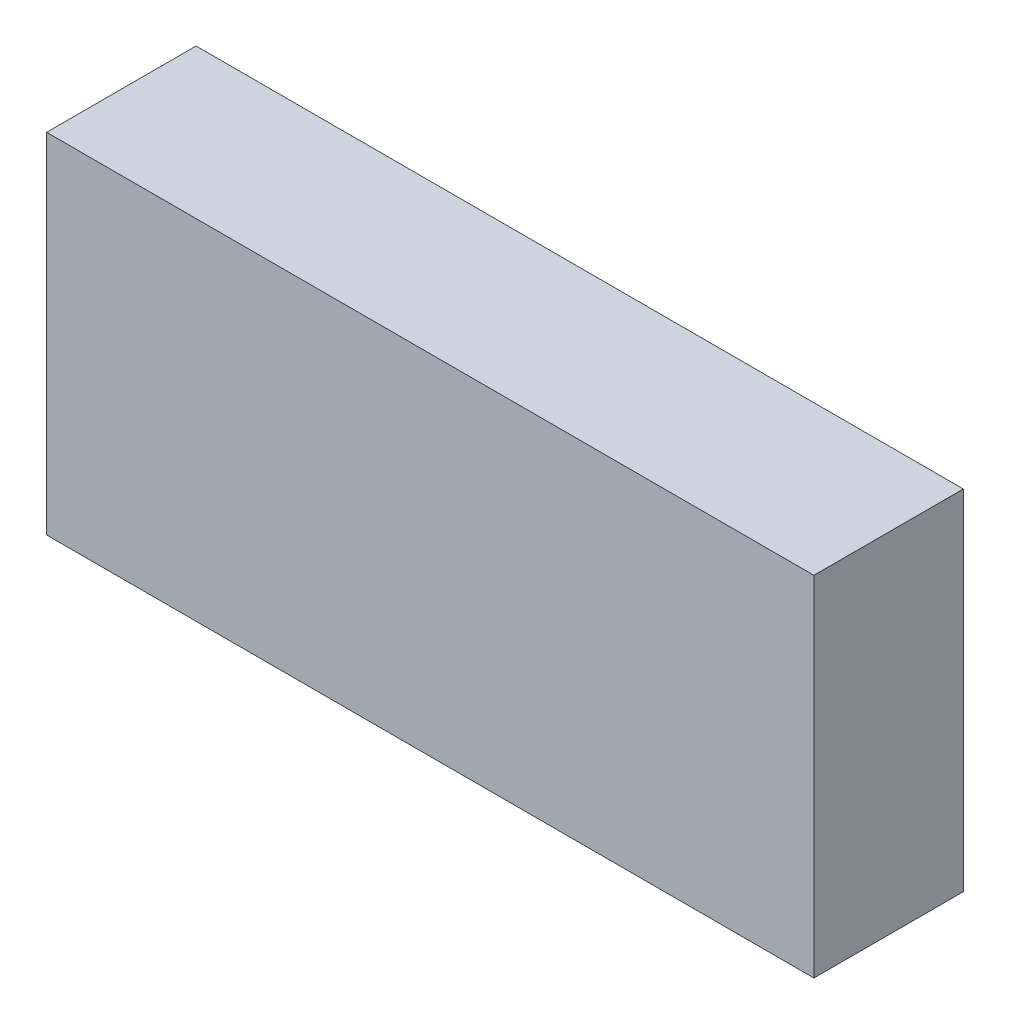
ISO-10303-21;
HEADER;
FILE_DESCRIPTION(('STEP AP214'),'2;1');
FILE_NAME('part.step','',(''),(''),'','','');
FILE_SCHEMA(('AUTOMOTIVE_DESIGN { 1 0 10303 214 1 1 1 1 }'));
ENDSEC;
DATA;
#1=APPLICATION_CONTEXT('core data for automotive mechanical design processes');
#2=APPLICATION_PROTOCOL_DEFINITION('international standard','automotive_design',2000,#1);
#3=PRODUCT_CONTEXT('',#1,'mechanical');
#4=PRODUCT('Part','Part','',(#3));
#5=PRODUCT_RELATED_PRODUCT_CATEGORY('part','',(#4));
#6=PRODUCT_DEFINITION_FORMATION('','',#4);
#7=PRODUCT_DEFINITION_CONTEXT('part definition',#1,'design');
#8=PRODUCT_DEFINITION('design','',#6,#7);
#9=PRODUCT_DEFINITION_SHAPE('','',#8);
#10=(LENGTH_UNIT() NAMED_UNIT(*) SI_UNIT(.MILLI.,.METRE.));
#11=(NAMED_UNIT(*) PLANE_ANGLE_UNIT() SI_UNIT($,.RADIAN.));
#12=(NAMED_UNIT(*) SI_UNIT($,.STERADIAN.) SOLID_ANGLE_UNIT());
#13=UNCERTAINTY_MEASURE_WITH_UNIT(LENGTH_MEASURE(1.E-05),#10,'distance_accuracy_value','');
#14=(GEOMETRIC_REPRESENTATION_CONTEXT(3) GLOBAL_UNCERTAINTY_ASSIGNED_CONTEXT((#13)) GLOBAL_UNIT_ASSIGNED_CONTEXT((#10,
#11,#12)) REPRESENTATION_CONTEXT('',''));
#15=CARTESIAN_POINT('',(0.,0.,0.));
#16=DIRECTION('',(0.,0.,1.));
#17=DIRECTION('',(1.,0.,0.));
#18=AXIS2_PLACEMENT_3D('',#15,#16,#17);
#19=CARTESIAN_POINT('',(38.5,-17.5,7.5));
#20=DIRECTION('',(-1.,0.,0.));
#21=DIRECTION('',(0.,0.,1.));
#22=AXIS2_PLACEMENT_3D('',#19,#20,#21);
#23=PLANE('',#22);
#24=DIRECTION('',(0.,1.,0.));
#25=VECTOR('',#24,1.);
#26=CARTESIAN_POINT('',(38.5,-17.5,-7.5));
#27=LINE('',#26,#25);
#28=CARTESIAN_POINT('',(38.5,-17.5,-7.5));
#29=VERTEX_POINT('',#28);
#30=CARTESIAN_POINT('',(38.5,17.5,-7.5));
#31=VERTEX_POINT('',#30);
#32=EDGE_CURVE('E99',#29,#31,#27,.T.);
#33=ORIENTED_EDGE('',*,*,#32,.T.);
#34=DIRECTION('',(0.,0.,-1.));
#35=VECTOR('',#34,1.);
#36=CARTESIAN_POINT('',(38.5,17.5,7.5));
#37=LINE('',#36,#35);
#38=CARTESIAN_POINT('',(38.5,17.5,7.5));
#39=VERTEX_POINT('',#38);
#40=EDGE_CURVE('E11',#39,#31,#37,.T.);
#41=ORIENTED_EDGE('',*,*,#40,.F.);
#42=DIRECTION('',(0.,1.,0.));
#43=VECTOR('',#42,1.);
#44=CARTESIAN_POINT('',(38.5,-17.5,7.5));
#45=LINE('',#44,#43);
#46=CARTESIAN_POINT('',(38.5,-17.5,7.5));
#47=VERTEX_POINT('',#46);
#48=EDGE_CURVE('E87',#47,#39,#45,.T.);
#49=ORIENTED_EDGE('',*,*,#48,.F.);
#50=DIRECTION('',(0.,0.,-1.));
#51=VECTOR('',#50,1.);
#52=CARTESIAN_POINT('',(38.5,-17.5,7.5));
#53=LINE('',#52,#51);
#54=EDGE_CURVE('E95',#47,#29,#53,.T.);
#55=ORIENTED_EDGE('',*,*,#54,.T.);
#56=EDGE_LOOP('',(#33,#41,#49,#55));
#57=FACE_BOUND('',#56,.T.);
#58=ADVANCED_FACE('F36',(#57),#23,.F.);
#59=CARTESIAN_POINT('',(-38.5,17.5,7.5));
#60=DIRECTION('',(0.,-1.,0.));
#61=DIRECTION('',(0.,0.,-1.));
#62=AXIS2_PLACEMENT_3D('',#59,#60,#61);
#63=PLANE('',#62);
#64=DIRECTION('',(-1.,0.,0.));
#65=VECTOR('',#64,1.);
#66=CARTESIAN_POINT('',(-38.5,17.5,-7.5));
#67=LINE('',#66,#65);
#68=CARTESIAN_POINT('',(-38.5,17.5,-7.5));
#69=VERTEX_POINT('',#68);
#70=EDGE_CURVE('E91',#31,#69,#67,.T.);
#71=ORIENTED_EDGE('',*,*,#70,.T.);
#72=DIRECTION('',(0.,0.,-1.));
#73=VECTOR('',#72,1.);
#74=CARTESIAN_POINT('',(-38.5,17.5,7.5));
#75=LINE('',#74,#73);
#76=CARTESIAN_POINT('',(-38.5,17.5,7.5));
#77=VERTEX_POINT('',#76);
#78=EDGE_CURVE('E44',#77,#69,#75,.T.);
#79=ORIENTED_EDGE('',*,*,#78,.F.);
#80=DIRECTION('',(-1.,0.,0.));
#81=VECTOR('',#80,1.);
#82=CARTESIAN_POINT('',(-38.5,17.5,7.5));
#83=LINE('',#82,#81);
#84=EDGE_CURVE('E82',#39,#77,#83,.T.);
#85=ORIENTED_EDGE('',*,*,#84,.F.);
#86=ORIENTED_EDGE('',*,*,#40,.T.);
#87=EDGE_LOOP('',(#71,#79,#85,#86));
#88=FACE_BOUND('',#87,.T.);
#89=ADVANCED_FACE('F90',(#88),#63,.F.);
#90=CARTESIAN_POINT('',(-38.5,-17.5,7.5));
#91=DIRECTION('',(1.,0.,0.));
#92=DIRECTION('',(0.,0.,-1.));
#93=AXIS2_PLACEMENT_3D('',#90,#91,#92);
#94=PLANE('',#93);
#95=DIRECTION('',(0.,-1.,0.));
#96=VECTOR('',#95,1.);
#97=CARTESIAN_POINT('',(-38.5,-17.5,-7.5));
#98=LINE('',#97,#96);
#99=CARTESIAN_POINT('',(-38.5,-17.5,-7.5));
#100=VERTEX_POINT('',#99);
#101=EDGE_CURVE('E69',#69,#100,#98,.T.);
#102=ORIENTED_EDGE('',*,*,#101,.T.);
#103=DIRECTION('',(0.,0.,-1.));
#104=VECTOR('',#103,1.);
#105=CARTESIAN_POINT('',(-38.5,-17.5,7.5));
#106=LINE('',#105,#104);
#107=CARTESIAN_POINT('',(-38.5,-17.5,7.5));
#108=VERTEX_POINT('',#107);
#109=EDGE_CURVE('E92',#108,#100,#106,.T.);
#110=ORIENTED_EDGE('',*,*,#109,.F.);
#111=DIRECTION('',(0.,-1.,0.));
#112=VECTOR('',#111,1.);
#113=CARTESIAN_POINT('',(-38.5,-17.5,7.5));
#114=LINE('',#113,#112);
#115=EDGE_CURVE('E85',#77,#108,#114,.T.);
#116=ORIENTED_EDGE('',*,*,#115,.F.);
#117=ORIENTED_EDGE('',*,*,#78,.T.);
#118=EDGE_LOOP('',(#102,#110,#116,#117));
#119=FACE_BOUND('',#118,.T.);
#120=ADVANCED_FACE('F93',(#119),#94,.F.);
#121=CARTESIAN_POINT('',(-38.5,-17.5,7.5));
#122=DIRECTION('',(0.,1.,0.));
#123=DIRECTION('',(0.,0.,1.));
#124=AXIS2_PLACEMENT_3D('',#121,#122,#123);
#125=PLANE('',#124);
#126=DIRECTION('',(1.,0.,0.));
#127=VECTOR('',#126,1.);
#128=CARTESIAN_POINT('',(-38.5,-17.5,-7.5));
#129=LINE('',#128,#127);
#130=EDGE_CURVE('E75',#100,#29,#129,.T.);
#131=ORIENTED_EDGE('',*,*,#130,.T.);
#132=ORIENTED_EDGE('',*,*,#54,.F.);
#133=DIRECTION('',(1.,0.,0.));
#134=VECTOR('',#133,1.);
#135=CARTESIAN_POINT('',(-38.5,-17.5,7.5));
#136=LINE('',#135,#134);
#137=EDGE_CURVE('E52',#108,#47,#136,.T.);
#138=ORIENTED_EDGE('',*,*,#137,.F.);
#139=ORIENTED_EDGE('',*,*,#109,.T.);
#140=EDGE_LOOP('',(#131,#132,#138,#139));
#141=FACE_BOUND('',#140,.T.);
#142=ADVANCED_FACE('F106',(#141),#125,.F.);
#143=CARTESIAN_POINT('',(0.,0.,7.5));
#144=DIRECTION('',(0.,0.,-1.));
#145=DIRECTION('',(-1.,0.,0.));
#146=AXIS2_PLACEMENT_3D('',#143,#144,#145);
#147=PLANE('',#146);
#148=ORIENTED_EDGE('',*,*,#48,.T.);
#149=ORIENTED_EDGE('',*,*,#84,.T.);
#150=ORIENTED_EDGE('',*,*,#115,.T.);
#151=ORIENTED_EDGE('',*,*,#137,.T.);
#152=EDGE_LOOP('',(#148,#149,#150,#151));
#153=FACE_BOUND('',#152,.T.);
#154=ADVANCED_FACE('F83',(#153),#147,.F.);
#155=CARTESIAN_POINT('',(0.,0.,-7.5));
#156=DIRECTION('',(0.,0.,-1.));
#157=DIRECTION('',(-1.,0.,0.));
#158=AXIS2_PLACEMENT_3D('',#155,#156,#157);
#159=PLANE('',#158);
#160=ORIENTED_EDGE('',*,*,#32,.F.);
#161=ORIENTED_EDGE('',*,*,#130,.F.);
#162=ORIENTED_EDGE('',*,*,#101,.F.);
#163=ORIENTED_EDGE('',*,*,#70,.F.);
#164=EDGE_LOOP('',(#160,#161,#162,#163));
#165=FACE_BOUND('',#164,.T.);
#166=ADVANCED_FACE('F109',(#165),#159,.T.);
#167=CLOSED_SHELL('',(#58,#89,#120,#142,#154,#166));
#168=MANIFOLD_SOLID_BREP('B2',#167);
#169=ADVANCED_BREP_SHAPE_REPRESENTATION('',(#18,#168),#14);
#170=SHAPE_DEFINITION_REPRESENTATION(#9,#169);
ENDSEC;
END-ISO-10303-21;
